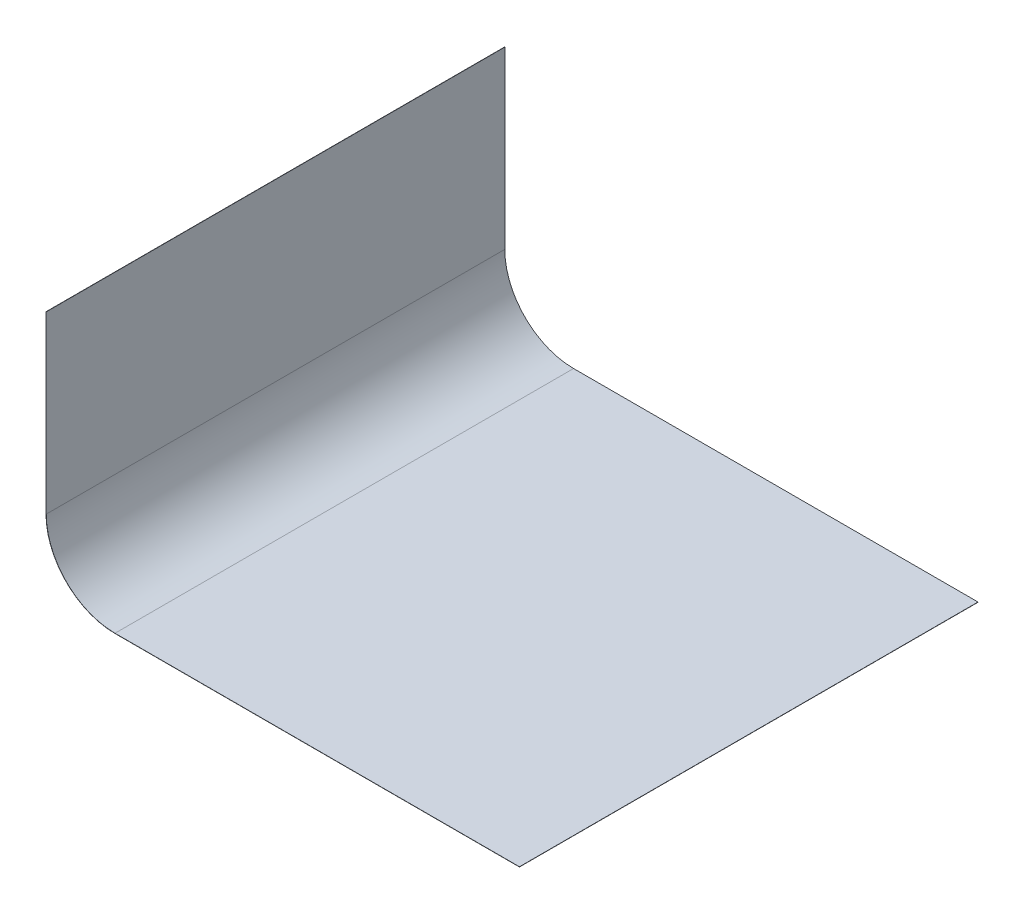
ISO-10303-21;
HEADER;
FILE_DESCRIPTION(('STEP AP214'),'2;1');
FILE_NAME('part.step','',(''),(''),'','','');
FILE_SCHEMA(('AUTOMOTIVE_DESIGN { 1 0 10303 214 1 1 1 1 }'));
ENDSEC;
DATA;
#1=APPLICATION_CONTEXT('core data for automotive mechanical design processes');
#2=APPLICATION_PROTOCOL_DEFINITION('international standard','automotive_design',2000,#1);
#3=PRODUCT_CONTEXT('',#1,'mechanical');
#4=PRODUCT('Part','Part','',(#3));
#5=PRODUCT_RELATED_PRODUCT_CATEGORY('part','',(#4));
#6=PRODUCT_DEFINITION_FORMATION('','',#4);
#7=PRODUCT_DEFINITION_CONTEXT('part definition',#1,'design');
#8=PRODUCT_DEFINITION('design','',#6,#7);
#9=PRODUCT_DEFINITION_SHAPE('','',#8);
#10=(LENGTH_UNIT() NAMED_UNIT(*) SI_UNIT(.MILLI.,.METRE.));
#11=(NAMED_UNIT(*) PLANE_ANGLE_UNIT() SI_UNIT($,.RADIAN.));
#12=(NAMED_UNIT(*) SI_UNIT($,.STERADIAN.) SOLID_ANGLE_UNIT());
#13=UNCERTAINTY_MEASURE_WITH_UNIT(LENGTH_MEASURE(1.E-05),#10,'distance_accuracy_value','');
#14=(GEOMETRIC_REPRESENTATION_CONTEXT(3) GLOBAL_UNCERTAINTY_ASSIGNED_CONTEXT((#13)) GLOBAL_UNIT_ASSIGNED_CONTEXT((#10,
#11,#12)) REPRESENTATION_CONTEXT('',''));
#15=CARTESIAN_POINT('',(0.,0.,0.));
#16=DIRECTION('',(0.,0.,1.));
#17=DIRECTION('',(1.,0.,0.));
#18=AXIS2_PLACEMENT_3D('',#15,#16,#17);
#19=CARTESIAN_POINT('',(-3.2833736646217,10.6398785189907,-6.2621359223301));
#20=DIRECTION('',(0.,0.,-1.));
#21=DIRECTION('',(0.,1.,0.));
#22=AXIS2_PLACEMENT_3D('',#19,#20,#21);
#23=PLANE('',#22);
#24=DIRECTION('',(0.,1.,0.));
#25=VECTOR('',#24,1.);
#26=CARTESIAN_POINT('',(-3.2733736646217,10.6398785189907,-6.2621359223301));
#27=LINE('',#26,#25);
#28=CARTESIAN_POINT('',(-3.27337366462172,3.00000000000001,-6.2621359223301));
#29=VERTEX_POINT('',#28);
#30=CARTESIAN_POINT('',(-3.2733736646217,10.6398785189907,-6.2621359223301));
#31=VERTEX_POINT('',#30);
#32=EDGE_CURVE('E67',#29,#31,#27,.T.);
#33=ORIENTED_EDGE('',*,*,#32,.F.);
#34=DIRECTION('',(-1.,0.,0.));
#35=VECTOR('',#34,1.);
#36=CARTESIAN_POINT('',(-3.28337366462172,3.00000000000001,-6.2621359223301));
#37=LINE('',#36,#35);
#38=CARTESIAN_POINT('',(-3.28337366462173,3.00000000000001,-6.2621359223301));
#39=VERTEX_POINT('',#38);
#40=EDGE_CURVE('E108',#29,#39,#37,.T.);
#41=ORIENTED_EDGE('',*,*,#40,.T.);
#42=DIRECTION('',(0.,1.,0.));
#43=VECTOR('',#42,1.);
#44=CARTESIAN_POINT('',(-3.2833736646217,10.6398785189907,-6.2621359223301));
#45=LINE('',#44,#43);
#46=CARTESIAN_POINT('',(-3.2833736646217,10.6398785189907,-6.2621359223301));
#47=VERTEX_POINT('',#46);
#48=EDGE_CURVE('E47',#39,#47,#45,.T.);
#49=ORIENTED_EDGE('',*,*,#48,.T.);
#50=DIRECTION('',(1.,0.,0.));
#51=VECTOR('',#50,1.);
#52=CARTESIAN_POINT('',(-3.2833736646217,10.6398785189907,-6.2621359223301));
#53=LINE('',#52,#51);
#54=EDGE_CURVE('E135',#47,#31,#53,.T.);
#55=ORIENTED_EDGE('',*,*,#54,.T.);
#56=EDGE_LOOP('',(#33,#41,#49,#55));
#57=FACE_BOUND('',#56,.T.);
#58=ADVANCED_FACE('F43',(#57),#23,.T.);
#59=CARTESIAN_POINT('',(-3.2833736646217,10.6398785189907,13.7378640776699));
#60=DIRECTION('',(0.,0.,1.));
#61=DIRECTION('',(0.,-1.,0.));
#62=AXIS2_PLACEMENT_3D('',#59,#60,#61);
#63=PLANE('',#62);
#64=DIRECTION('',(0.,-1.,0.));
#65=VECTOR('',#64,1.);
#66=CARTESIAN_POINT('',(-3.2833736646217,10.6398785189907,13.7378640776699));
#67=LINE('',#66,#65);
#68=CARTESIAN_POINT('',(-3.2833736646217,10.6398785189907,13.7378640776699));
#69=VERTEX_POINT('',#68);
#70=CARTESIAN_POINT('',(-3.28337366462172,3.00000000000001,13.7378640776699));
#71=VERTEX_POINT('',#70);
#72=EDGE_CURVE('E126',#69,#71,#67,.T.);
#73=ORIENTED_EDGE('',*,*,#72,.T.);
#74=DIRECTION('',(1.,0.,0.));
#75=VECTOR('',#74,1.);
#76=CARTESIAN_POINT('',(-3.28337366462172,3.00000000000001,13.7378640776699));
#77=LINE('',#76,#75);
#78=CARTESIAN_POINT('',(-3.27337366462172,3.00000000000001,13.7378640776699));
#79=VERTEX_POINT('',#78);
#80=EDGE_CURVE('E12',#71,#79,#77,.T.);
#81=ORIENTED_EDGE('',*,*,#80,.T.);
#82=DIRECTION('',(0.,-1.,0.));
#83=VECTOR('',#82,1.);
#84=CARTESIAN_POINT('',(-3.2733736646217,10.6398785189907,13.7378640776699));
#85=LINE('',#84,#83);
#86=CARTESIAN_POINT('',(-3.2733736646217,10.6398785189907,13.7378640776699));
#87=VERTEX_POINT('',#86);
#88=EDGE_CURVE('E60',#87,#79,#85,.T.);
#89=ORIENTED_EDGE('',*,*,#88,.F.);
#90=DIRECTION('',(1.,0.,0.));
#91=VECTOR('',#90,1.);
#92=CARTESIAN_POINT('',(-3.2833736646217,10.6398785189907,13.7378640776699));
#93=LINE('',#92,#91);
#94=EDGE_CURVE('E125',#69,#87,#93,.T.);
#95=ORIENTED_EDGE('',*,*,#94,.F.);
#96=EDGE_LOOP('',(#73,#81,#89,#95));
#97=FACE_BOUND('',#96,.T.);
#98=ADVANCED_FACE('F45',(#97),#63,.T.);
#99=CARTESIAN_POINT('',(-3.27337366462174,-1.99361662664039,0.));
#100=DIRECTION('',(1.,0.,0.));
#101=DIRECTION('',(0.,0.,1.));
#102=AXIS2_PLACEMENT_3D('',#99,#100,#101);
#103=PLANE('',#102);
#104=ORIENTED_EDGE('',*,*,#88,.T.);
#105=DIRECTION('',(0.,0.,-1.));
#106=VECTOR('',#105,1.);
#107=CARTESIAN_POINT('',(-3.27337366462172,3.00000000000001,0.));
#108=LINE('',#107,#106);
#109=EDGE_CURVE('E52',#79,#29,#108,.T.);
#110=ORIENTED_EDGE('',*,*,#109,.T.);
#111=ORIENTED_EDGE('',*,*,#32,.T.);
#112=DIRECTION('',(0.,0.,1.));
#113=VECTOR('',#112,1.);
#114=CARTESIAN_POINT('',(-3.2733736646217,10.6398785189907,-6.2621359223301));
#115=LINE('',#114,#113);
#116=EDGE_CURVE('E156',#31,#87,#115,.T.);
#117=ORIENTED_EDGE('',*,*,#116,.T.);
#118=EDGE_LOOP('',(#104,#110,#111,#117));
#119=FACE_BOUND('',#118,.T.);
#120=ADVANCED_FACE('F185',(#119),#103,.T.);
#121=CARTESIAN_POINT('',(-3.2833736646217,10.6398785189907,-6.2621359223301));
#122=DIRECTION('',(0.,1.,0.));
#123=DIRECTION('',(0.,0.,1.));
#124=AXIS2_PLACEMENT_3D('',#121,#122,#123);
#125=PLANE('',#124);
#126=ORIENTED_EDGE('',*,*,#116,.F.);
#127=ORIENTED_EDGE('',*,*,#54,.F.);
#128=DIRECTION('',(0.,0.,1.));
#129=VECTOR('',#128,1.);
#130=CARTESIAN_POINT('',(-3.2833736646217,10.6398785189907,-6.2621359223301));
#131=LINE('',#130,#129);
#132=EDGE_CURVE('E124',#47,#69,#131,.T.);
#133=ORIENTED_EDGE('',*,*,#132,.T.);
#134=ORIENTED_EDGE('',*,*,#94,.T.);
#135=EDGE_LOOP('',(#126,#127,#133,#134));
#136=FACE_BOUND('',#135,.T.);
#137=ADVANCED_FACE('F189',(#136),#125,.T.);
#138=CARTESIAN_POINT('',(-3.28337366462174,-1.99361662664039,0.));
#139=DIRECTION('',(1.,0.,0.));
#140=DIRECTION('',(0.,0.,1.));
#141=AXIS2_PLACEMENT_3D('',#138,#139,#140);
#142=PLANE('',#141);
#143=DIRECTION('',(0.,0.,-1.));
#144=VECTOR('',#143,1.);
#145=CARTESIAN_POINT('',(-3.28337366462172,3.00000000000001,0.));
#146=LINE('',#145,#144);
#147=EDGE_CURVE('E115',#71,#39,#146,.T.);
#148=ORIENTED_EDGE('',*,*,#147,.F.);
#149=ORIENTED_EDGE('',*,*,#72,.F.);
#150=ORIENTED_EDGE('',*,*,#132,.F.);
#151=ORIENTED_EDGE('',*,*,#48,.F.);
#152=EDGE_LOOP('',(#148,#149,#150,#151));
#153=FACE_BOUND('',#152,.T.);
#154=ADVANCED_FACE('F120',(#153),#142,.F.);
#155=CARTESIAN_POINT('',(17.3665048543689,-0.01,-6.2621359223301));
#156=DIRECTION('',(1.,0.,0.));
#157=DIRECTION('',(0.,0.,-1.));
#158=AXIS2_PLACEMENT_3D('',#155,#156,#157);
#159=PLANE('',#158);
#160=DIRECTION('',(0.,0.,-1.));
#161=VECTOR('',#160,1.);
#162=CARTESIAN_POINT('',(17.3665048543689,0.,-6.2621359223301));
#163=LINE('',#162,#161);
#164=CARTESIAN_POINT('',(17.3665048543689,0.,13.7378640776699));
#165=VERTEX_POINT('',#164);
#166=CARTESIAN_POINT('',(17.3665048543689,0.,-6.2621359223301));
#167=VERTEX_POINT('',#166);
#168=EDGE_CURVE('E161',#165,#167,#163,.T.);
#169=ORIENTED_EDGE('',*,*,#168,.F.);
#170=DIRECTION('',(0.,1.,0.));
#171=VECTOR('',#170,1.);
#172=CARTESIAN_POINT('',(17.3665048543689,-0.01,13.7378640776699));
#173=LINE('',#172,#171);
#174=CARTESIAN_POINT('',(17.3665048543689,-0.01,13.7378640776699));
#175=VERTEX_POINT('',#174);
#176=EDGE_CURVE('E153',#175,#165,#173,.T.);
#177=ORIENTED_EDGE('',*,*,#176,.F.);
#178=DIRECTION('',(0.,0.,-1.));
#179=VECTOR('',#178,1.);
#180=CARTESIAN_POINT('',(17.3665048543689,-0.01,-6.2621359223301));
#181=LINE('',#180,#179);
#182=CARTESIAN_POINT('',(17.3665048543689,-0.01,-6.2621359223301));
#183=VERTEX_POINT('',#182);
#184=EDGE_CURVE('E173',#175,#183,#181,.T.);
#185=ORIENTED_EDGE('',*,*,#184,.T.);
#186=DIRECTION('',(0.,1.,0.));
#187=VECTOR('',#186,1.);
#188=CARTESIAN_POINT('',(17.3665048543689,-0.01,-6.2621359223301));
#189=LINE('',#188,#187);
#190=EDGE_CURVE('E171',#183,#167,#189,.T.);
#191=ORIENTED_EDGE('',*,*,#190,.T.);
#192=EDGE_LOOP('',(#169,#177,#185,#191));
#193=FACE_BOUND('',#192,.T.);
#194=ADVANCED_FACE('F213',(#193),#159,.T.);
#195=CARTESIAN_POINT('',(0.,-0.01,0.));
#196=DIRECTION('',(0.,1.,0.));
#197=DIRECTION('',(0.,0.,1.));
#198=AXIS2_PLACEMENT_3D('',#195,#196,#197);
#199=PLANE('',#198);
#200=DIRECTION('',(1.,0.,0.));
#201=VECTOR('',#200,1.);
#202=CARTESIAN_POINT('',(-12.6334951456311,-0.01,13.7378640776699));
#203=LINE('',#202,#201);
#204=CARTESIAN_POINT('',(-0.273373664621724,-0.01,13.7378640776699));
#205=VERTEX_POINT('',#204);
#206=EDGE_CURVE('E157',#205,#175,#203,.T.);
#207=ORIENTED_EDGE('',*,*,#206,.F.);
#208=DIRECTION('',(0.,0.,-1.));
#209=VECTOR('',#208,1.);
#210=CARTESIAN_POINT('',(-0.273373664621725,-0.01,0.));
#211=LINE('',#210,#209);
#212=CARTESIAN_POINT('',(-0.273373664621725,-0.01,-6.2621359223301));
#213=VERTEX_POINT('',#212);
#214=EDGE_CURVE('E168',#205,#213,#211,.T.);
#215=ORIENTED_EDGE('',*,*,#214,.T.);
#216=DIRECTION('',(-1.,0.,0.));
#217=VECTOR('',#216,1.);
#218=CARTESIAN_POINT('',(-12.6334951456311,-0.01,-6.2621359223301));
#219=LINE('',#218,#217);
#220=EDGE_CURVE('E166',#183,#213,#219,.T.);
#221=ORIENTED_EDGE('',*,*,#220,.F.);
#222=ORIENTED_EDGE('',*,*,#184,.F.);
#223=EDGE_LOOP('',(#207,#215,#221,#222));
#224=FACE_BOUND('',#223,.T.);
#225=ADVANCED_FACE('F211',(#224),#199,.F.);
#226=CARTESIAN_POINT('',(-12.6334951456311,-0.01,-6.2621359223301));
#227=DIRECTION('',(0.,0.,-1.));
#228=DIRECTION('',(-1.,0.,0.));
#229=AXIS2_PLACEMENT_3D('',#226,#227,#228);
#230=PLANE('',#229);
#231=DIRECTION('',(0.,-1.,0.));
#232=VECTOR('',#231,1.);
#233=CARTESIAN_POINT('',(-0.273373664621724,-0.01,-6.2621359223301));
#234=LINE('',#233,#232);
#235=CARTESIAN_POINT('',(-0.273373664621724,0.,-6.2621359223301));
#236=VERTEX_POINT('',#235);
#237=EDGE_CURVE('E140',#236,#213,#234,.T.);
#238=ORIENTED_EDGE('',*,*,#237,.F.);
#239=DIRECTION('',(-1.,0.,0.));
#240=VECTOR('',#239,1.);
#241=CARTESIAN_POINT('',(-12.6334951456311,0.,-6.2621359223301));
#242=LINE('',#241,#240);
#243=EDGE_CURVE('E159',#167,#236,#242,.T.);
#244=ORIENTED_EDGE('',*,*,#243,.F.);
#245=ORIENTED_EDGE('',*,*,#190,.F.);
#246=ORIENTED_EDGE('',*,*,#220,.T.);
#247=EDGE_LOOP('',(#238,#244,#245,#246));
#248=FACE_BOUND('',#247,.T.);
#249=ADVANCED_FACE('F207',(#248),#230,.T.);
#250=CARTESIAN_POINT('',(0.,0.,0.));
#251=DIRECTION('',(0.,1.,0.));
#252=DIRECTION('',(0.,0.,1.));
#253=AXIS2_PLACEMENT_3D('',#250,#251,#252);
#254=PLANE('',#253);
#255=DIRECTION('',(0.,0.,-1.));
#256=VECTOR('',#255,1.);
#257=CARTESIAN_POINT('',(-0.273373664621725,0.,0.));
#258=LINE('',#257,#256);
#259=CARTESIAN_POINT('',(-0.273373664621724,0.,13.7378640776699));
#260=VERTEX_POINT('',#259);
#261=EDGE_CURVE('E144',#260,#236,#258,.T.);
#262=ORIENTED_EDGE('',*,*,#261,.F.);
#263=DIRECTION('',(1.,0.,0.));
#264=VECTOR('',#263,1.);
#265=CARTESIAN_POINT('',(-12.6334951456311,0.,13.7378640776699));
#266=LINE('',#265,#264);
#267=EDGE_CURVE('E164',#260,#165,#266,.T.);
#268=ORIENTED_EDGE('',*,*,#267,.T.);
#269=ORIENTED_EDGE('',*,*,#168,.T.);
#270=ORIENTED_EDGE('',*,*,#243,.T.);
#271=EDGE_LOOP('',(#262,#268,#269,#270));
#272=FACE_BOUND('',#271,.T.);
#273=ADVANCED_FACE('F204',(#272),#254,.T.);
#274=CARTESIAN_POINT('',(-12.6334951456311,-0.01,13.7378640776699));
#275=DIRECTION('',(0.,0.,1.));
#276=DIRECTION('',(1.,0.,0.));
#277=AXIS2_PLACEMENT_3D('',#274,#275,#276);
#278=PLANE('',#277);
#279=DIRECTION('',(0.,1.,0.));
#280=VECTOR('',#279,1.);
#281=CARTESIAN_POINT('',(-0.273373664621723,-0.01,13.7378640776699));
#282=LINE('',#281,#280);
#283=EDGE_CURVE('E141',#205,#260,#282,.T.);
#284=ORIENTED_EDGE('',*,*,#283,.F.);
#285=ORIENTED_EDGE('',*,*,#206,.T.);
#286=ORIENTED_EDGE('',*,*,#176,.T.);
#287=ORIENTED_EDGE('',*,*,#267,.F.);
#288=EDGE_LOOP('',(#284,#285,#286,#287));
#289=FACE_BOUND('',#288,.T.);
#290=ADVANCED_FACE('F199',(#289),#278,.T.);
#291=CARTESIAN_POINT('',(-0.273373664621723,3.,13.7378640776699));
#292=DIRECTION('',(0.,0.,1.));
#293=DIRECTION('',(1.,0.,0.));
#294=AXIS2_PLACEMENT_3D('',#291,#292,#293);
#295=PLANE('',#294);
#296=ORIENTED_EDGE('',*,*,#283,.T.);
#297=CARTESIAN_POINT('',(-0.273373664621723,3.,13.7378640776699));
#298=DIRECTION('',(0.,0.,-1.));
#299=DIRECTION('',(-1.,0.,0.));
#300=AXIS2_PLACEMENT_3D('',#297,#298,#299);
#301=CIRCLE('',#300,3.);
#302=EDGE_CURVE('E150',#260,#79,#301,.T.);
#303=ORIENTED_EDGE('',*,*,#302,.T.);
#304=ORIENTED_EDGE('',*,*,#80,.F.);
#305=CARTESIAN_POINT('',(-0.273373664621723,3.,13.7378640776699));
#306=DIRECTION('',(0.,0.,-1.));
#307=DIRECTION('',(1.,0.,0.));
#308=AXIS2_PLACEMENT_3D('',#305,#306,#307);
#309=CIRCLE('',#308,3.01);
#310=EDGE_CURVE('E134',#205,#71,#309,.T.);
#311=ORIENTED_EDGE('',*,*,#310,.F.);
#312=EDGE_LOOP('',(#296,#303,#304,#311));
#313=FACE_BOUND('',#312,.T.);
#314=ADVANCED_FACE('F196',(#313),#295,.T.);
#315=CARTESIAN_POINT('',(-0.273373664621725,3.,-6.2621359223301));
#316=DIRECTION('',(0.,0.,-1.));
#317=DIRECTION('',(-1.,0.,0.));
#318=AXIS2_PLACEMENT_3D('',#315,#316,#317);
#319=PLANE('',#318);
#320=ORIENTED_EDGE('',*,*,#40,.F.);
#321=CARTESIAN_POINT('',(-0.273373664621725,3.,-6.2621359223301));
#322=DIRECTION('',(0.,0.,-1.));
#323=DIRECTION('',(-1.,0.,0.));
#324=AXIS2_PLACEMENT_3D('',#321,#322,#323);
#325=CIRCLE('',#324,3.);
#326=EDGE_CURVE('E146',#29,#236,#325,.F.);
#327=ORIENTED_EDGE('',*,*,#326,.T.);
#328=ORIENTED_EDGE('',*,*,#237,.T.);
#329=CARTESIAN_POINT('',(-0.273373664621725,3.,-6.2621359223301));
#330=DIRECTION('',(0.,0.,1.));
#331=DIRECTION('',(-1.,0.,0.));
#332=AXIS2_PLACEMENT_3D('',#329,#330,#331);
#333=CIRCLE('',#332,3.01);
#334=EDGE_CURVE('E132',#39,#213,#333,.T.);
#335=ORIENTED_EDGE('',*,*,#334,.F.);
#336=EDGE_LOOP('',(#320,#327,#328,#335));
#337=FACE_BOUND('',#336,.T.);
#338=ADVANCED_FACE('F138',(#337),#319,.T.);
#339=CARTESIAN_POINT('',(-0.273373664621723,3.,24.2873359351286));
#340=DIRECTION('',(0.,0.,-1.));
#341=DIRECTION('',(-1.,0.,0.));
#342=AXIS2_PLACEMENT_3D('',#339,#340,#341);
#343=CYLINDRICAL_SURFACE('',#342,3.01);
#344=ORIENTED_EDGE('',*,*,#334,.T.);
#345=ORIENTED_EDGE('',*,*,#214,.F.);
#346=ORIENTED_EDGE('',*,*,#310,.T.);
#347=ORIENTED_EDGE('',*,*,#147,.T.);
#348=EDGE_LOOP('',(#344,#345,#346,#347));
#349=FACE_BOUND('',#348,.T.);
#350=ADVANCED_FACE('F130',(#349),#343,.T.);
#351=CARTESIAN_POINT('',(-0.273373664621723,3.,24.2873359351286));
#352=DIRECTION('',(0.,0.,-1.));
#353=DIRECTION('',(-1.,0.,0.));
#354=AXIS2_PLACEMENT_3D('',#351,#352,#353);
#355=CYLINDRICAL_SURFACE('',#354,3.);
#356=ORIENTED_EDGE('',*,*,#326,.F.);
#357=ORIENTED_EDGE('',*,*,#109,.F.);
#358=ORIENTED_EDGE('',*,*,#302,.F.);
#359=ORIENTED_EDGE('',*,*,#261,.T.);
#360=EDGE_LOOP('',(#356,#357,#358,#359));
#361=FACE_BOUND('',#360,.T.);
#362=ADVANCED_FACE('F195',(#361),#355,.F.);
#363=CLOSED_SHELL('',(#58,#98,#120,#137,#154,#194,#225,#249,#273,#290,#314,#338,#350,#362));
#364=MANIFOLD_SOLID_BREP('B2',#363);
#365=ADVANCED_BREP_SHAPE_REPRESENTATION('',(#18,#364),#14);
#366=SHAPE_DEFINITION_REPRESENTATION(#9,#365);
ENDSEC;
END-ISO-10303-21;
